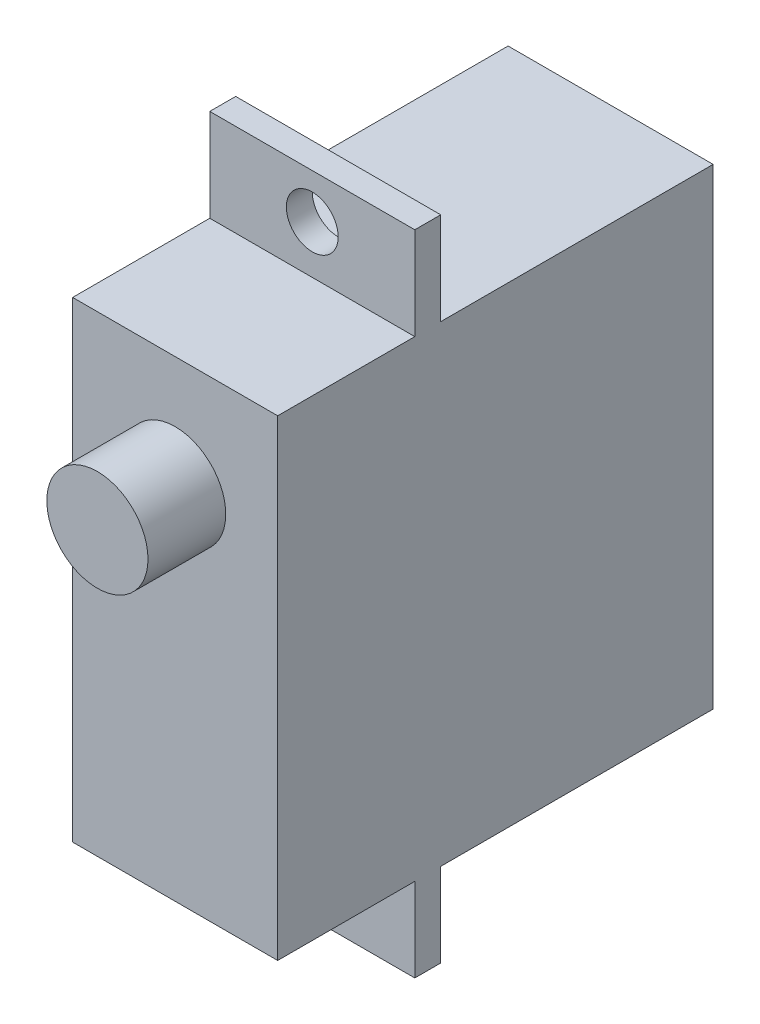
ISO-10303-21;
HEADER;
FILE_DESCRIPTION(('STEP AP214'),'2;1');
FILE_NAME('part.step','',(''),(''),'','','');
FILE_SCHEMA(('AUTOMOTIVE_DESIGN { 1 0 10303 214 1 1 1 1 }'));
ENDSEC;
DATA;
#1=APPLICATION_CONTEXT('core data for automotive mechanical design processes');
#2=APPLICATION_PROTOCOL_DEFINITION('international standard','automotive_design',2000,#1);
#3=PRODUCT_CONTEXT('',#1,'mechanical');
#4=PRODUCT('Part','Part','',(#3));
#5=PRODUCT_RELATED_PRODUCT_CATEGORY('part','',(#4));
#6=PRODUCT_DEFINITION_FORMATION('','',#4);
#7=PRODUCT_DEFINITION_CONTEXT('part definition',#1,'design');
#8=PRODUCT_DEFINITION('design','',#6,#7);
#9=PRODUCT_DEFINITION_SHAPE('','',#8);
#10=(LENGTH_UNIT() NAMED_UNIT(*) SI_UNIT(.MILLI.,.METRE.));
#11=(NAMED_UNIT(*) PLANE_ANGLE_UNIT() SI_UNIT($,.RADIAN.));
#12=(NAMED_UNIT(*) SI_UNIT($,.STERADIAN.) SOLID_ANGLE_UNIT());
#13=UNCERTAINTY_MEASURE_WITH_UNIT(LENGTH_MEASURE(1.E-05),#10,'distance_accuracy_value','');
#14=(GEOMETRIC_REPRESENTATION_CONTEXT(3) GLOBAL_UNCERTAINTY_ASSIGNED_CONTEXT((#13)) GLOBAL_UNIT_ASSIGNED_CONTEXT((#10,
#11,#12)) REPRESENTATION_CONTEXT('',''));
#15=CARTESIAN_POINT('',(0.,0.,0.));
#16=DIRECTION('',(0.,0.,1.));
#17=DIRECTION('',(1.,0.,0.));
#18=AXIS2_PLACEMENT_3D('',#15,#16,#17);
#19=CARTESIAN_POINT('',(7.91,15.6241978014453,14.7600080226867));
#20=DIRECTION('',(0.,-1.,0.));
#21=DIRECTION('',(0.,0.,-1.));
#22=AXIS2_PLACEMENT_3D('',#19,#20,#21);
#23=PLANE('',#22);
#24=DIRECTION('',(-1.,0.,0.));
#25=VECTOR('',#24,1.);
#26=CARTESIAN_POINT('',(7.91,15.6241978014453,8.47000802268666));
#27=LINE('',#26,#25);
#28=CARTESIAN_POINT('',(7.91,15.6241978014453,8.47000802268666));
#29=VERTEX_POINT('',#28);
#30=CARTESIAN_POINT('',(0.,15.6241978014453,8.47000802268666));
#31=VERTEX_POINT('',#30);
#32=EDGE_CURVE('E171',#29,#31,#27,.T.);
#33=ORIENTED_EDGE('',*,*,#32,.F.);
#34=DIRECTION('',(0.,0.,1.));
#35=VECTOR('',#34,1.);
#36=CARTESIAN_POINT('',(7.91,15.6241978014453,14.7600080226867));
#37=LINE('',#36,#35);
#38=CARTESIAN_POINT('',(7.91,15.6241978014453,-2.03999197731334));
#39=VERTEX_POINT('',#38);
#40=EDGE_CURVE('E184',#39,#29,#37,.T.);
#41=ORIENTED_EDGE('',*,*,#40,.F.);
#42=DIRECTION('',(-1.,0.,0.));
#43=VECTOR('',#42,1.);
#44=CARTESIAN_POINT('',(7.91,15.6241978014453,-2.03999197731334));
#45=LINE('',#44,#43);
#46=CARTESIAN_POINT('',(0.,15.6241978014453,-2.03999197731334));
#47=VERTEX_POINT('',#46);
#48=EDGE_CURVE('E43',#39,#47,#45,.T.);
#49=ORIENTED_EDGE('',*,*,#48,.T.);
#50=DIRECTION('',(0.,0.,1.));
#51=VECTOR('',#50,1.);
#52=CARTESIAN_POINT('',(0.,15.6241978014453,14.7600080226867));
#53=LINE('',#52,#51);
#54=EDGE_CURVE('E194',#47,#31,#53,.T.);
#55=ORIENTED_EDGE('',*,*,#54,.T.);
#56=EDGE_LOOP('',(#33,#41,#49,#55));
#57=FACE_BOUND('',#56,.T.);
#58=ADVANCED_FACE('F35',(#57),#23,.F.);
#59=CARTESIAN_POINT('',(7.91,-2.57580219855472,14.7600080226867));
#60=DIRECTION('',(0.,1.,0.));
#61=DIRECTION('',(0.,0.,1.));
#62=AXIS2_PLACEMENT_3D('',#59,#60,#61);
#63=PLANE('',#62);
#64=DIRECTION('',(1.,0.,0.));
#65=VECTOR('',#64,1.);
#66=CARTESIAN_POINT('',(7.91,-2.57580219855472,8.47000802268666));
#67=LINE('',#66,#65);
#68=CARTESIAN_POINT('',(0.,-2.57580219855472,8.47000802268666));
#69=VERTEX_POINT('',#68);
#70=CARTESIAN_POINT('',(7.91,-2.57580219855472,8.47000802268666));
#71=VERTEX_POINT('',#70);
#72=EDGE_CURVE('E169',#69,#71,#67,.T.);
#73=ORIENTED_EDGE('',*,*,#72,.F.);
#74=DIRECTION('',(0.,0.,-1.));
#75=VECTOR('',#74,1.);
#76=CARTESIAN_POINT('',(0.,-2.57580219855472,14.7600080226867));
#77=LINE('',#76,#75);
#78=CARTESIAN_POINT('',(0.,-2.57580219855472,-2.03999197731334));
#79=VERTEX_POINT('',#78);
#80=EDGE_CURVE('E198',#69,#79,#77,.T.);
#81=ORIENTED_EDGE('',*,*,#80,.T.);
#82=DIRECTION('',(-1.,0.,0.));
#83=VECTOR('',#82,1.);
#84=CARTESIAN_POINT('',(7.91,-2.57580219855472,-2.03999197731334));
#85=LINE('',#84,#83);
#86=CARTESIAN_POINT('',(7.91,-2.57580219855472,-2.03999197731334));
#87=VERTEX_POINT('',#86);
#88=EDGE_CURVE('E190',#87,#79,#85,.T.);
#89=ORIENTED_EDGE('',*,*,#88,.F.);
#90=DIRECTION('',(0.,0.,-1.));
#91=VECTOR('',#90,1.);
#92=CARTESIAN_POINT('',(7.91,-2.57580219855472,14.7600080226867));
#93=LINE('',#92,#91);
#94=EDGE_CURVE('E50',#71,#87,#93,.T.);
#95=ORIENTED_EDGE('',*,*,#94,.F.);
#96=EDGE_LOOP('',(#73,#81,#89,#95));
#97=FACE_BOUND('',#96,.T.);
#98=ADVANCED_FACE('F257',(#97),#63,.F.);
#99=CARTESIAN_POINT('',(7.91,15.6241978014453,-2.03999197731334));
#100=DIRECTION('',(0.,0.,1.));
#101=DIRECTION('',(0.,-1.,0.));
#102=AXIS2_PLACEMENT_3D('',#99,#100,#101);
#103=PLANE('',#102);
#104=DIRECTION('',(0.,1.,0.));
#105=VECTOR('',#104,1.);
#106=CARTESIAN_POINT('',(0.,15.6241978014453,-2.03999197731334));
#107=LINE('',#106,#105);
#108=EDGE_CURVE('E178',#79,#47,#107,.T.);
#109=ORIENTED_EDGE('',*,*,#108,.T.);
#110=ORIENTED_EDGE('',*,*,#48,.F.);
#111=DIRECTION('',(0.,1.,0.));
#112=VECTOR('',#111,1.);
#113=CARTESIAN_POINT('',(7.91,15.6241978014453,-2.03999197731334));
#114=LINE('',#113,#112);
#115=EDGE_CURVE('E179',#87,#39,#114,.T.);
#116=ORIENTED_EDGE('',*,*,#115,.F.);
#117=ORIENTED_EDGE('',*,*,#88,.T.);
#118=EDGE_LOOP('',(#109,#110,#116,#117));
#119=FACE_BOUND('',#118,.T.);
#120=ADVANCED_FACE('F37',(#119),#103,.F.);
#121=CARTESIAN_POINT('',(7.91,15.6241978014453,9.47000802268666));
#122=VERTEX_POINT('',#121);
#123=CARTESIAN_POINT('',(7.91,15.6241978014453,14.7600080226867));
#124=VERTEX_POINT('',#123);
#125=EDGE_CURVE('E182',#122,#124,#37,.T.);
#126=ORIENTED_EDGE('',*,*,#125,.F.);
#127=DIRECTION('',(-1.,0.,0.));
#128=VECTOR('',#127,1.);
#129=CARTESIAN_POINT('',(7.91,15.6241978014453,9.47000802268666));
#130=LINE('',#129,#128);
#131=CARTESIAN_POINT('',(0.,15.6241978014453,9.47000802268666));
#132=VERTEX_POINT('',#131);
#133=EDGE_CURVE('E175',#122,#132,#130,.T.);
#134=ORIENTED_EDGE('',*,*,#133,.T.);
#135=CARTESIAN_POINT('',(0.,15.6241978014453,14.7600080226867));
#136=VERTEX_POINT('',#135);
#137=EDGE_CURVE('E193',#132,#136,#53,.T.);
#138=ORIENTED_EDGE('',*,*,#137,.T.);
#139=DIRECTION('',(-1.,0.,0.));
#140=VECTOR('',#139,1.);
#141=CARTESIAN_POINT('',(7.91,15.6241978014453,14.7600080226867));
#142=LINE('',#141,#140);
#143=EDGE_CURVE('E205',#124,#136,#142,.T.);
#144=ORIENTED_EDGE('',*,*,#143,.F.);
#145=EDGE_LOOP('',(#126,#134,#138,#144));
#146=FACE_BOUND('',#145,.T.);
#147=ADVANCED_FACE('F273',(#146),#23,.F.);
#148=CARTESIAN_POINT('',(7.91,15.6241978014453,14.7600080226867));
#149=DIRECTION('',(0.,0.,-1.));
#150=DIRECTION('',(0.,1.,0.));
#151=AXIS2_PLACEMENT_3D('',#148,#149,#150);
#152=PLANE('',#151);
#153=CARTESIAN_POINT('',(3.955,11.3331948655234,14.7600080226867));
#154=DIRECTION('',(0.,0.,-1.));
#155=DIRECTION('',(0.,1.,0.));
#156=AXIS2_PLACEMENT_3D('',#153,#154,#155);
#157=CIRCLE('',#156,1.95158077469917);
#158=CARTESIAN_POINT('',(3.955,13.2847756402225,14.7600080226867));
#159=VERTEX_POINT('',#158);
#160=EDGE_CURVE('E11',#159,#159,#157,.F.);
#161=ORIENTED_EDGE('',*,*,#160,.F.);
#162=EDGE_LOOP('',(#161));
#163=FACE_BOUND('',#162,.T.);
#164=DIRECTION('',(0.,-1.,0.));
#165=VECTOR('',#164,1.);
#166=CARTESIAN_POINT('',(0.,15.6241978014453,14.7600080226867));
#167=LINE('',#166,#165);
#168=CARTESIAN_POINT('',(0.,-2.57580219855472,14.7600080226867));
#169=VERTEX_POINT('',#168);
#170=EDGE_CURVE('E196',#136,#169,#167,.T.);
#171=ORIENTED_EDGE('',*,*,#170,.T.);
#172=DIRECTION('',(-1.,0.,0.));
#173=VECTOR('',#172,1.);
#174=CARTESIAN_POINT('',(7.91,-2.57580219855472,14.7600080226867));
#175=LINE('',#174,#173);
#176=CARTESIAN_POINT('',(7.91,-2.57580219855472,14.7600080226867));
#177=VERTEX_POINT('',#176);
#178=EDGE_CURVE('E202',#177,#169,#175,.T.);
#179=ORIENTED_EDGE('',*,*,#178,.F.);
#180=DIRECTION('',(0.,-1.,0.));
#181=VECTOR('',#180,1.);
#182=CARTESIAN_POINT('',(7.91,15.6241978014453,14.7600080226867));
#183=LINE('',#182,#181);
#184=EDGE_CURVE('E187',#124,#177,#183,.T.);
#185=ORIENTED_EDGE('',*,*,#184,.F.);
#186=ORIENTED_EDGE('',*,*,#143,.T.);
#187=EDGE_LOOP('',(#171,#179,#185,#186));
#188=FACE_BOUND('',#187,.T.);
#189=ADVANCED_FACE('F281',(#163,#188),#152,.F.);
#190=CARTESIAN_POINT('',(0.,-2.57580219855472,9.47000802268666));
#191=VERTEX_POINT('',#190);
#192=EDGE_CURVE('E183',#169,#191,#77,.T.);
#193=ORIENTED_EDGE('',*,*,#192,.T.);
#194=DIRECTION('',(1.,0.,0.));
#195=VECTOR('',#194,1.);
#196=CARTESIAN_POINT('',(7.91,-2.57580219855472,9.47000802268666));
#197=LINE('',#196,#195);
#198=CARTESIAN_POINT('',(7.91,-2.57580219855472,9.47000802268666));
#199=VERTEX_POINT('',#198);
#200=EDGE_CURVE('E58',#191,#199,#197,.T.);
#201=ORIENTED_EDGE('',*,*,#200,.T.);
#202=EDGE_CURVE('E132',#177,#199,#93,.T.);
#203=ORIENTED_EDGE('',*,*,#202,.F.);
#204=ORIENTED_EDGE('',*,*,#178,.T.);
#205=EDGE_LOOP('',(#193,#201,#203,#204));
#206=FACE_BOUND('',#205,.T.);
#207=ADVANCED_FACE('F278',(#206),#63,.F.);
#208=CARTESIAN_POINT('',(7.91,0.,0.));
#209=DIRECTION('',(1.,0.,0.));
#210=DIRECTION('',(0.,0.,-1.));
#211=AXIS2_PLACEMENT_3D('',#208,#209,#210);
#212=PLANE('',#211);
#213=ORIENTED_EDGE('',*,*,#202,.T.);
#214=DIRECTION('',(0.,-1.,0.));
#215=VECTOR('',#214,1.);
#216=CARTESIAN_POINT('',(7.91,19.1945208126603,9.47000802268666));
#217=LINE('',#216,#215);
#218=CARTESIAN_POINT('',(7.91,-5.80547918733974,9.47000802268666));
#219=VERTEX_POINT('',#218);
#220=EDGE_CURVE('E126',#199,#219,#217,.T.);
#221=ORIENTED_EDGE('',*,*,#220,.T.);
#222=DIRECTION('',(0.,0.,-1.));
#223=VECTOR('',#222,1.);
#224=CARTESIAN_POINT('',(7.91,-5.80547918733974,9.47000802268666));
#225=LINE('',#224,#223);
#226=CARTESIAN_POINT('',(7.91,-5.80547918733974,8.47000802268666));
#227=VERTEX_POINT('',#226);
#228=EDGE_CURVE('E131',#219,#227,#225,.T.);
#229=ORIENTED_EDGE('',*,*,#228,.T.);
#230=DIRECTION('',(0.,-1.,0.));
#231=VECTOR('',#230,1.);
#232=CARTESIAN_POINT('',(7.91,19.1945208126603,8.47000802268666));
#233=LINE('',#232,#231);
#234=EDGE_CURVE('E151',#71,#227,#233,.T.);
#235=ORIENTED_EDGE('',*,*,#234,.F.);
#236=ORIENTED_EDGE('',*,*,#94,.T.);
#237=ORIENTED_EDGE('',*,*,#115,.T.);
#238=ORIENTED_EDGE('',*,*,#40,.T.);
#239=CARTESIAN_POINT('',(7.91,19.1945208126603,8.47000802268666));
#240=VERTEX_POINT('',#239);
#241=EDGE_CURVE('E153',#240,#29,#233,.T.);
#242=ORIENTED_EDGE('',*,*,#241,.F.);
#243=DIRECTION('',(0.,0.,-1.));
#244=VECTOR('',#243,1.);
#245=CARTESIAN_POINT('',(7.91,19.1945208126603,9.47000802268666));
#246=LINE('',#245,#244);
#247=CARTESIAN_POINT('',(7.91,19.1945208126603,9.47000802268666));
#248=VERTEX_POINT('',#247);
#249=EDGE_CURVE('E146',#248,#240,#246,.T.);
#250=ORIENTED_EDGE('',*,*,#249,.F.);
#251=EDGE_CURVE('E134',#248,#122,#217,.T.);
#252=ORIENTED_EDGE('',*,*,#251,.T.);
#253=ORIENTED_EDGE('',*,*,#125,.T.);
#254=ORIENTED_EDGE('',*,*,#184,.T.);
#255=EDGE_LOOP('',(#213,#221,#229,#235,#236,#237,#238,#242,#250,#252,#253,#254));
#256=FACE_BOUND('',#255,.T.);
#257=ADVANCED_FACE('F128',(#256),#212,.T.);
#258=CARTESIAN_POINT('',(0.,0.,0.));
#259=DIRECTION('',(1.,0.,0.));
#260=DIRECTION('',(0.,0.,-1.));
#261=AXIS2_PLACEMENT_3D('',#258,#259,#260);
#262=PLANE('',#261);
#263=ORIENTED_EDGE('',*,*,#137,.F.);
#264=DIRECTION('',(0.,1.,0.));
#265=VECTOR('',#264,1.);
#266=CARTESIAN_POINT('',(0.,19.1945208126603,9.47000802268666));
#267=LINE('',#266,#265);
#268=CARTESIAN_POINT('',(0.,19.1945208126603,9.47000802268666));
#269=VERTEX_POINT('',#268);
#270=EDGE_CURVE('E231',#132,#269,#267,.T.);
#271=ORIENTED_EDGE('',*,*,#270,.T.);
#272=DIRECTION('',(0.,0.,1.));
#273=VECTOR('',#272,1.);
#274=CARTESIAN_POINT('',(0.,19.1945208126603,9.47000802268666));
#275=LINE('',#274,#273);
#276=CARTESIAN_POINT('',(0.,19.1945208126603,8.47000802268666));
#277=VERTEX_POINT('',#276);
#278=EDGE_CURVE('E229',#277,#269,#275,.T.);
#279=ORIENTED_EDGE('',*,*,#278,.F.);
#280=DIRECTION('',(0.,1.,0.));
#281=VECTOR('',#280,1.);
#282=CARTESIAN_POINT('',(0.,19.1945208126603,8.47000802268666));
#283=LINE('',#282,#281);
#284=EDGE_CURVE('E163',#31,#277,#283,.T.);
#285=ORIENTED_EDGE('',*,*,#284,.F.);
#286=ORIENTED_EDGE('',*,*,#54,.F.);
#287=ORIENTED_EDGE('',*,*,#108,.F.);
#288=ORIENTED_EDGE('',*,*,#80,.F.);
#289=CARTESIAN_POINT('',(0.,-5.80547918733974,8.47000802268666));
#290=VERTEX_POINT('',#289);
#291=EDGE_CURVE('E226',#290,#69,#283,.T.);
#292=ORIENTED_EDGE('',*,*,#291,.F.);
#293=DIRECTION('',(0.,0.,1.));
#294=VECTOR('',#293,1.);
#295=CARTESIAN_POINT('',(0.,-5.80547918733974,9.47000802268666));
#296=LINE('',#295,#294);
#297=CARTESIAN_POINT('',(0.,-5.80547918733974,9.47000802268666));
#298=VERTEX_POINT('',#297);
#299=EDGE_CURVE('E167',#290,#298,#296,.T.);
#300=ORIENTED_EDGE('',*,*,#299,.T.);
#301=EDGE_CURVE('E142',#298,#191,#267,.T.);
#302=ORIENTED_EDGE('',*,*,#301,.T.);
#303=ORIENTED_EDGE('',*,*,#192,.F.);
#304=ORIENTED_EDGE('',*,*,#170,.F.);
#305=EDGE_LOOP('',(#263,#271,#279,#285,#286,#287,#288,#292,#300,#302,#303,#304));
#306=FACE_BOUND('',#305,.T.);
#307=ADVANCED_FACE('F236',(#306),#262,.F.);
#308=CARTESIAN_POINT('',(-25.0199920063936,-5.80547918733974,9.47000802268666));
#309=DIRECTION('',(0.,-1.,0.));
#310=DIRECTION('',(0.,0.,-1.));
#311=AXIS2_PLACEMENT_3D('',#308,#309,#310);
#312=PLANE('',#311);
#313=ORIENTED_EDGE('',*,*,#299,.F.);
#314=DIRECTION('',(1.,0.,0.));
#315=VECTOR('',#314,1.);
#316=CARTESIAN_POINT('',(-25.0199920063936,-5.80547918733974,8.47000802268666));
#317=LINE('',#316,#315);
#318=EDGE_CURVE('E145',#290,#227,#317,.T.);
#319=ORIENTED_EDGE('',*,*,#318,.T.);
#320=ORIENTED_EDGE('',*,*,#228,.F.);
#321=DIRECTION('',(1.,0.,0.));
#322=VECTOR('',#321,1.);
#323=CARTESIAN_POINT('',(-25.0199920063936,-5.80547918733974,9.47000802268666));
#324=LINE('',#323,#322);
#325=EDGE_CURVE('E139',#298,#219,#324,.T.);
#326=ORIENTED_EDGE('',*,*,#325,.F.);
#327=EDGE_LOOP('',(#313,#319,#320,#326));
#328=FACE_BOUND('',#327,.T.);
#329=ADVANCED_FACE('F149',(#328),#312,.T.);
#330=CARTESIAN_POINT('',(-25.0199920063936,19.1945208126603,8.47000802268666));
#331=DIRECTION('',(0.,0.,1.));
#332=DIRECTION('',(1.,0.,0.));
#333=AXIS2_PLACEMENT_3D('',#330,#331,#332);
#334=PLANE('',#333);
#335=CARTESIAN_POINT('',(3.955,-4.43080219855472,8.47000802268666));
#336=DIRECTION('',(0.,0.,1.));
#337=DIRECTION('',(1.,0.,0.));
#338=AXIS2_PLACEMENT_3D('',#335,#336,#337);
#339=CIRCLE('',#338,1.);
#340=CARTESIAN_POINT('',(4.955,-4.43080219855472,8.47000802268666));
#341=VERTEX_POINT('',#340);
#342=EDGE_CURVE('E135',#341,#341,#339,.T.);
#343=ORIENTED_EDGE('',*,*,#342,.T.);
#344=EDGE_LOOP('',(#343));
#345=FACE_BOUND('',#344,.T.);
#346=ORIENTED_EDGE('',*,*,#291,.T.);
#347=ORIENTED_EDGE('',*,*,#72,.T.);
#348=ORIENTED_EDGE('',*,*,#234,.T.);
#349=ORIENTED_EDGE('',*,*,#318,.F.);
#350=EDGE_LOOP('',(#346,#347,#348,#349));
#351=FACE_BOUND('',#350,.T.);
#352=ADVANCED_FACE('F259',(#345,#351),#334,.F.);
#353=CARTESIAN_POINT('',(-25.0199920063936,19.1945208126603,9.47000802268666));
#354=DIRECTION('',(0.,0.,1.));
#355=DIRECTION('',(1.,0.,0.));
#356=AXIS2_PLACEMENT_3D('',#353,#354,#355);
#357=PLANE('',#356);
#358=CARTESIAN_POINT('',(3.955,-4.43080219855472,9.47000802268666));
#359=DIRECTION('',(0.,0.,1.));
#360=DIRECTION('',(1.,0.,0.));
#361=AXIS2_PLACEMENT_3D('',#358,#359,#360);
#362=CIRCLE('',#361,1.);
#363=CARTESIAN_POINT('',(4.955,-4.43080219855472,9.47000802268666));
#364=VERTEX_POINT('',#363);
#365=EDGE_CURVE('E217',#364,#364,#362,.T.);
#366=ORIENTED_EDGE('',*,*,#365,.F.);
#367=EDGE_LOOP('',(#366));
#368=FACE_BOUND('',#367,.T.);
#369=ORIENTED_EDGE('',*,*,#200,.F.);
#370=ORIENTED_EDGE('',*,*,#301,.F.);
#371=ORIENTED_EDGE('',*,*,#325,.T.);
#372=ORIENTED_EDGE('',*,*,#220,.F.);
#373=EDGE_LOOP('',(#369,#370,#371,#372));
#374=FACE_BOUND('',#373,.T.);
#375=ADVANCED_FACE('F140',(#368,#374),#357,.T.);
#376=CARTESIAN_POINT('',(3.955,17.4791978014453,9.47000802268666));
#377=DIRECTION('',(0.,0.,1.));
#378=DIRECTION('',(1.,0.,0.));
#379=AXIS2_PLACEMENT_3D('',#376,#377,#378);
#380=CIRCLE('',#379,1.);
#381=CARTESIAN_POINT('',(4.955,17.4791978014453,9.47000802268666));
#382=VERTEX_POINT('',#381);
#383=EDGE_CURVE('E211',#382,#382,#380,.T.);
#384=ORIENTED_EDGE('',*,*,#383,.F.);
#385=EDGE_LOOP('',(#384));
#386=FACE_BOUND('',#385,.T.);
#387=ORIENTED_EDGE('',*,*,#133,.F.);
#388=ORIENTED_EDGE('',*,*,#251,.F.);
#389=DIRECTION('',(1.,0.,0.));
#390=VECTOR('',#389,1.);
#391=CARTESIAN_POINT('',(-25.0199920063936,19.1945208126603,9.47000802268666));
#392=LINE('',#391,#390);
#393=EDGE_CURVE('E161',#269,#248,#392,.T.);
#394=ORIENTED_EDGE('',*,*,#393,.F.);
#395=ORIENTED_EDGE('',*,*,#270,.F.);
#396=EDGE_LOOP('',(#387,#388,#394,#395));
#397=FACE_BOUND('',#396,.T.);
#398=ADVANCED_FACE('F247',(#386,#397),#357,.T.);
#399=CARTESIAN_POINT('',(3.955,17.4791978014453,8.47000802268666));
#400=DIRECTION('',(0.,0.,1.));
#401=DIRECTION('',(1.,0.,0.));
#402=AXIS2_PLACEMENT_3D('',#399,#400,#401);
#403=CIRCLE('',#402,1.);
#404=CARTESIAN_POINT('',(4.955,17.4791978014453,8.47000802268666));
#405=VERTEX_POINT('',#404);
#406=EDGE_CURVE('E209',#405,#405,#403,.T.);
#407=ORIENTED_EDGE('',*,*,#406,.T.);
#408=EDGE_LOOP('',(#407));
#409=FACE_BOUND('',#408,.T.);
#410=ORIENTED_EDGE('',*,*,#241,.T.);
#411=ORIENTED_EDGE('',*,*,#32,.T.);
#412=ORIENTED_EDGE('',*,*,#284,.T.);
#413=DIRECTION('',(1.,0.,0.));
#414=VECTOR('',#413,1.);
#415=CARTESIAN_POINT('',(-25.0199920063936,19.1945208126603,8.47000802268666));
#416=LINE('',#415,#414);
#417=EDGE_CURVE('E164',#277,#240,#416,.T.);
#418=ORIENTED_EDGE('',*,*,#417,.T.);
#419=EDGE_LOOP('',(#410,#411,#412,#418));
#420=FACE_BOUND('',#419,.T.);
#421=ADVANCED_FACE('F251',(#409,#420),#334,.F.);
#422=CARTESIAN_POINT('',(-25.0199920063936,19.1945208126603,9.47000802268666));
#423=DIRECTION('',(0.,-1.,0.));
#424=DIRECTION('',(0.,0.,-1.));
#425=AXIS2_PLACEMENT_3D('',#422,#423,#424);
#426=PLANE('',#425);
#427=ORIENTED_EDGE('',*,*,#417,.F.);
#428=ORIENTED_EDGE('',*,*,#278,.T.);
#429=ORIENTED_EDGE('',*,*,#393,.T.);
#430=ORIENTED_EDGE('',*,*,#249,.T.);
#431=EDGE_LOOP('',(#427,#428,#429,#430));
#432=FACE_BOUND('',#431,.T.);
#433=ADVANCED_FACE('F244',(#432),#426,.F.);
#434=CARTESIAN_POINT('',(3.955,17.4791978014453,-12.4299919773133));
#435=DIRECTION('',(0.,0.,1.));
#436=DIRECTION('',(1.,0.,0.));
#437=AXIS2_PLACEMENT_3D('',#434,#435,#436);
#438=CYLINDRICAL_SURFACE('',#437,1.);
#439=ORIENTED_EDGE('',*,*,#383,.T.);
#440=EDGE_LOOP('',(#439));
#441=FACE_BOUND('',#440,.T.);
#442=ORIENTED_EDGE('',*,*,#406,.F.);
#443=EDGE_LOOP('',(#442));
#444=FACE_BOUND('',#443,.T.);
#445=ADVANCED_FACE('F315',(#441,#444),#438,.F.);
#446=CARTESIAN_POINT('',(3.955,-4.43080219855472,-12.4299919773133));
#447=DIRECTION('',(0.,0.,1.));
#448=DIRECTION('',(1.,0.,0.));
#449=AXIS2_PLACEMENT_3D('',#446,#447,#448);
#450=CYLINDRICAL_SURFACE('',#449,1.);
#451=ORIENTED_EDGE('',*,*,#365,.T.);
#452=EDGE_LOOP('',(#451));
#453=FACE_BOUND('',#452,.T.);
#454=ORIENTED_EDGE('',*,*,#342,.F.);
#455=EDGE_LOOP('',(#454));
#456=FACE_BOUND('',#455,.T.);
#457=ADVANCED_FACE('F321',(#453,#456),#450,.F.);
#458=CARTESIAN_POINT('',(3.955,11.3331948655234,17.7600080226867));
#459=DIRECTION('',(0.,0.,-1.));
#460=DIRECTION('',(-1.,0.,0.));
#461=AXIS2_PLACEMENT_3D('',#458,#459,#460);
#462=CYLINDRICAL_SURFACE('',#461,1.95158077469917);
#463=CARTESIAN_POINT('',(3.955,11.3331948655234,17.7600080226867));
#464=DIRECTION('',(0.,0.,1.));
#465=DIRECTION('',(1.,0.,0.));
#466=AXIS2_PLACEMENT_3D('',#463,#464,#465);
#467=CIRCLE('',#466,1.95158077469917);
#468=CARTESIAN_POINT('',(5.90658077469917,11.3331948655234,17.7600080226867));
#469=VERTEX_POINT('',#468);
#470=EDGE_CURVE('E222',#469,#469,#467,.T.);
#471=ORIENTED_EDGE('',*,*,#470,.F.);
#472=EDGE_LOOP('',(#471));
#473=FACE_BOUND('',#472,.T.);
#474=ORIENTED_EDGE('',*,*,#160,.T.);
#475=EDGE_LOOP('',(#474));
#476=FACE_BOUND('',#475,.T.);
#477=ADVANCED_FACE('F328',(#473,#476),#462,.T.);
#478=CARTESIAN_POINT('',(3.955,11.3331948655234,17.7600080226867));
#479=DIRECTION('',(0.,0.,1.));
#480=DIRECTION('',(1.,0.,0.));
#481=AXIS2_PLACEMENT_3D('',#478,#479,#480);
#482=PLANE('',#481);
#483=ORIENTED_EDGE('',*,*,#470,.T.);
#484=EDGE_LOOP('',(#483));
#485=FACE_BOUND('',#484,.T.);
#486=ADVANCED_FACE('F337',(#485),#482,.T.);
#487=CLOSED_SHELL('',(#58,#98,#120,#147,#189,#207,#257,#307,#329,#352,#375,#398,#421,#433,#445,
#457,#477,#486));
#488=MANIFOLD_SOLID_BREP('B2',#487);
#489=ADVANCED_BREP_SHAPE_REPRESENTATION('',(#18,#488),#14);
#490=SHAPE_DEFINITION_REPRESENTATION(#9,#489);
ENDSEC;
END-ISO-10303-21;
